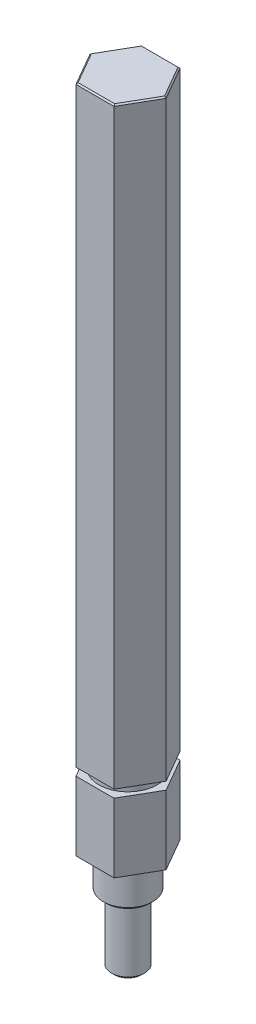
ISO-10303-21;
HEADER;
FILE_DESCRIPTION(('STEP AP214'),'2;1');
FILE_NAME('part.step','',(''),(''),'','','');
FILE_SCHEMA(('AUTOMOTIVE_DESIGN { 1 0 10303 214 1 1 1 1 }'));
ENDSEC;
DATA;
#1=APPLICATION_CONTEXT('core data for automotive mechanical design processes');
#2=APPLICATION_PROTOCOL_DEFINITION('international standard','automotive_design',2000,#1);
#3=PRODUCT_CONTEXT('',#1,'mechanical');
#4=PRODUCT('Part','Part','',(#3));
#5=PRODUCT_RELATED_PRODUCT_CATEGORY('part','',(#4));
#6=PRODUCT_DEFINITION_FORMATION('','',#4);
#7=PRODUCT_DEFINITION_CONTEXT('part definition',#1,'design');
#8=PRODUCT_DEFINITION('design','',#6,#7);
#9=PRODUCT_DEFINITION_SHAPE('','',#8);
#10=(LENGTH_UNIT() NAMED_UNIT(*) SI_UNIT(.MILLI.,.METRE.));
#11=(NAMED_UNIT(*) PLANE_ANGLE_UNIT() SI_UNIT($,.RADIAN.));
#12=(NAMED_UNIT(*) SI_UNIT($,.STERADIAN.) SOLID_ANGLE_UNIT());
#13=UNCERTAINTY_MEASURE_WITH_UNIT(LENGTH_MEASURE(1.E-05),#10,'distance_accuracy_value','');
#14=(GEOMETRIC_REPRESENTATION_CONTEXT(3) GLOBAL_UNCERTAINTY_ASSIGNED_CONTEXT((#13)) GLOBAL_UNIT_ASSIGNED_CONTEXT((#10,
#11,#12)) REPRESENTATION_CONTEXT('',''));
#15=CARTESIAN_POINT('',(0.,0.,0.));
#16=DIRECTION('',(0.,0.,1.));
#17=DIRECTION('',(1.,0.,0.));
#18=AXIS2_PLACEMENT_3D('',#15,#16,#17);
#19=CARTESIAN_POINT('',(0.,-12.1158,0.));
#20=DIRECTION('',(0.,-1.,0.));
#21=DIRECTION('',(0.,0.,-1.));
#22=AXIS2_PLACEMENT_3D('',#19,#20,#21);
#23=PLANE('',#22);
#24=DIRECTION('',(-0.500000000000001,0.,-0.866025403784438));
#25=VECTOR('',#24,1.);
#26=CARTESIAN_POINT('',(-41.9733079254973,-12.1158,-10.319011646302));
#27=LINE('',#26,#25);
#28=CARTESIAN_POINT('',(-41.9733079254973,-12.1158,-10.319011646302));
#29=VERTEX_POINT('',#28);
#30=CARTESIAN_POINT('',(-45.6394821348514,-12.1158,-16.669011646302));
#31=VERTEX_POINT('',#30);
#32=EDGE_CURVE('E183',#29,#31,#27,.T.);
#33=ORIENTED_EDGE('',*,*,#32,.F.);
#34=DIRECTION('',(-1.,0.,0.));
#35=VECTOR('',#34,1.);
#36=CARTESIAN_POINT('',(-34.640959506789,-12.1158,-10.319011646302));
#37=LINE('',#36,#35);
#38=CARTESIAN_POINT('',(-34.640959506789,-12.1158,-10.319011646302));
#39=VERTEX_POINT('',#38);
#40=EDGE_CURVE('E199',#39,#29,#37,.T.);
#41=ORIENTED_EDGE('',*,*,#40,.F.);
#42=DIRECTION('',(-0.500000000000001,0.,0.866025403784438));
#43=VECTOR('',#42,1.);
#44=CARTESIAN_POINT('',(-30.9747852974349,-12.1158,-16.669011646302));
#45=LINE('',#44,#43);
#46=CARTESIAN_POINT('',(-30.9747852974349,-12.1158,-16.669011646302));
#47=VERTEX_POINT('',#46);
#48=EDGE_CURVE('E196',#47,#39,#45,.T.);
#49=ORIENTED_EDGE('',*,*,#48,.F.);
#50=DIRECTION('',(0.500000000000001,0.,0.866025403784438));
#51=VECTOR('',#50,1.);
#52=CARTESIAN_POINT('',(-34.640959506789,-12.1158,-23.019011646302));
#53=LINE('',#52,#51);
#54=CARTESIAN_POINT('',(-34.640959506789,-12.1158,-23.019011646302));
#55=VERTEX_POINT('',#54);
#56=EDGE_CURVE('E193',#55,#47,#53,.T.);
#57=ORIENTED_EDGE('',*,*,#56,.F.);
#58=DIRECTION('',(1.,0.,0.));
#59=VECTOR('',#58,1.);
#60=CARTESIAN_POINT('',(-41.9733079254973,-12.1158,-23.019011646302));
#61=LINE('',#60,#59);
#62=CARTESIAN_POINT('',(-41.9733079254973,-12.1158,-23.019011646302));
#63=VERTEX_POINT('',#62);
#64=EDGE_CURVE('E190',#63,#55,#61,.T.);
#65=ORIENTED_EDGE('',*,*,#64,.F.);
#66=DIRECTION('',(0.5,0.,-0.866025403784439));
#67=VECTOR('',#66,1.);
#68=CARTESIAN_POINT('',(-45.6394821348514,-12.1158,-16.669011646302));
#69=LINE('',#68,#67);
#70=EDGE_CURVE('E186',#31,#63,#69,.T.);
#71=ORIENTED_EDGE('',*,*,#70,.F.);
#72=EDGE_LOOP('',(#33,#41,#49,#57,#65,#71));
#73=FACE_BOUND('',#72,.T.);
#74=CARTESIAN_POINT('',(-38.3071337161431,-12.1158,-16.669011646302));
#75=DIRECTION('',(0.,-1.,0.));
#76=DIRECTION('',(0.,0.,-1.));
#77=AXIS2_PLACEMENT_3D('',#74,#75,#76);
#78=CIRCLE('',#77,5.58800000000003);
#79=CARTESIAN_POINT('',(-38.3071337161431,-12.1158,-22.257011646302));
#80=VERTEX_POINT('',#79);
#81=EDGE_CURVE('E221',#80,#80,#78,.F.);
#82=ORIENTED_EDGE('',*,*,#81,.F.);
#83=EDGE_LOOP('',(#82));
#84=FACE_BOUND('',#83,.T.);
#85=ADVANCED_FACE('F32',(#73,#84),#23,.F.);
#86=CARTESIAN_POINT('',(-41.9733079254973,-12.1158,-10.319011646302));
#87=DIRECTION('',(-0.866025403784438,0.,0.500000000000001));
#88=DIRECTION('',(0.500000000000001,0.,0.866025403784438));
#89=AXIS2_PLACEMENT_3D('',#86,#87,#88);
#90=PLANE('',#89);
#91=DIRECTION('',(-0.500000000000001,0.,-0.866025403784438));
#92=VECTOR('',#91,1.);
#93=CARTESIAN_POINT('',(-41.9733079254973,-25.4,-10.319011646302));
#94=LINE('',#93,#92);
#95=CARTESIAN_POINT('',(-41.9733079254973,-25.4,-10.319011646302));
#96=VERTEX_POINT('',#95);
#97=CARTESIAN_POINT('',(-45.6394821348514,-25.4,-16.669011646302));
#98=VERTEX_POINT('',#97);
#99=EDGE_CURVE('E182',#96,#98,#94,.T.);
#100=ORIENTED_EDGE('',*,*,#99,.F.);
#101=DIRECTION('',(0.,-1.,0.));
#102=VECTOR('',#101,1.);
#103=CARTESIAN_POINT('',(-41.9733079254973,-12.1158,-10.319011646302));
#104=LINE('',#103,#102);
#105=EDGE_CURVE('E219',#29,#96,#104,.T.);
#106=ORIENTED_EDGE('',*,*,#105,.F.);
#107=ORIENTED_EDGE('',*,*,#32,.T.);
#108=DIRECTION('',(0.,-1.,0.));
#109=VECTOR('',#108,1.);
#110=CARTESIAN_POINT('',(-45.6394821348514,-12.1158,-16.669011646302));
#111=LINE('',#110,#109);
#112=EDGE_CURVE('E202',#31,#98,#111,.T.);
#113=ORIENTED_EDGE('',*,*,#112,.T.);
#114=EDGE_LOOP('',(#100,#106,#107,#113));
#115=FACE_BOUND('',#114,.T.);
#116=ADVANCED_FACE('F324',(#115),#90,.T.);
#117=CARTESIAN_POINT('',(-34.640959506789,-12.1158,-10.319011646302));
#118=DIRECTION('',(0.,0.,1.));
#119=DIRECTION('',(1.,0.,0.));
#120=AXIS2_PLACEMENT_3D('',#117,#118,#119);
#121=PLANE('',#120);
#122=DIRECTION('',(-1.,0.,0.));
#123=VECTOR('',#122,1.);
#124=CARTESIAN_POINT('',(-34.640959506789,-25.4,-10.319011646302));
#125=LINE('',#124,#123);
#126=CARTESIAN_POINT('',(-34.640959506789,-25.4,-10.319011646302));
#127=VERTEX_POINT('',#126);
#128=EDGE_CURVE('E187',#127,#96,#125,.T.);
#129=ORIENTED_EDGE('',*,*,#128,.F.);
#130=DIRECTION('',(0.,-1.,0.));
#131=VECTOR('',#130,1.);
#132=CARTESIAN_POINT('',(-34.640959506789,-12.1158,-10.319011646302));
#133=LINE('',#132,#131);
#134=EDGE_CURVE('E222',#39,#127,#133,.T.);
#135=ORIENTED_EDGE('',*,*,#134,.F.);
#136=ORIENTED_EDGE('',*,*,#40,.T.);
#137=ORIENTED_EDGE('',*,*,#105,.T.);
#138=EDGE_LOOP('',(#129,#135,#136,#137));
#139=FACE_BOUND('',#138,.T.);
#140=ADVANCED_FACE('F330',(#139),#121,.T.);
#141=CARTESIAN_POINT('',(-30.9747852974349,-12.1158,-16.669011646302));
#142=DIRECTION('',(0.866025403784438,0.,0.500000000000001));
#143=DIRECTION('',(0.500000000000001,0.,-0.866025403784438));
#144=AXIS2_PLACEMENT_3D('',#141,#142,#143);
#145=PLANE('',#144);
#146=DIRECTION('',(-0.500000000000001,0.,0.866025403784438));
#147=VECTOR('',#146,1.);
#148=CARTESIAN_POINT('',(-30.9747852974349,-25.4,-16.669011646302));
#149=LINE('',#148,#147);
#150=CARTESIAN_POINT('',(-30.9747852974349,-25.4,-16.669011646302));
#151=VERTEX_POINT('',#150);
#152=EDGE_CURVE('E214',#151,#127,#149,.T.);
#153=ORIENTED_EDGE('',*,*,#152,.F.);
#154=DIRECTION('',(0.,-1.,0.));
#155=VECTOR('',#154,1.);
#156=CARTESIAN_POINT('',(-30.9747852974349,-12.1158,-16.669011646302));
#157=LINE('',#156,#155);
#158=EDGE_CURVE('E224',#47,#151,#157,.T.);
#159=ORIENTED_EDGE('',*,*,#158,.F.);
#160=ORIENTED_EDGE('',*,*,#48,.T.);
#161=ORIENTED_EDGE('',*,*,#134,.T.);
#162=EDGE_LOOP('',(#153,#159,#160,#161));
#163=FACE_BOUND('',#162,.T.);
#164=ADVANCED_FACE('F346',(#163),#145,.T.);
#165=CARTESIAN_POINT('',(-34.640959506789,-12.1158,-23.019011646302));
#166=DIRECTION('',(0.866025403784438,0.,-0.500000000000001));
#167=DIRECTION('',(-0.500000000000001,0.,-0.866025403784438));
#168=AXIS2_PLACEMENT_3D('',#165,#166,#167);
#169=PLANE('',#168);
#170=DIRECTION('',(0.500000000000001,0.,0.866025403784438));
#171=VECTOR('',#170,1.);
#172=CARTESIAN_POINT('',(-34.640959506789,-25.4,-23.019011646302));
#173=LINE('',#172,#171);
#174=CARTESIAN_POINT('',(-34.640959506789,-25.4,-23.019011646302));
#175=VERTEX_POINT('',#174);
#176=EDGE_CURVE('E211',#175,#151,#173,.T.);
#177=ORIENTED_EDGE('',*,*,#176,.F.);
#178=DIRECTION('',(0.,-1.,0.));
#179=VECTOR('',#178,1.);
#180=CARTESIAN_POINT('',(-34.640959506789,-12.1158,-23.019011646302));
#181=LINE('',#180,#179);
#182=EDGE_CURVE('E226',#55,#175,#181,.T.);
#183=ORIENTED_EDGE('',*,*,#182,.F.);
#184=ORIENTED_EDGE('',*,*,#56,.T.);
#185=ORIENTED_EDGE('',*,*,#158,.T.);
#186=EDGE_LOOP('',(#177,#183,#184,#185));
#187=FACE_BOUND('',#186,.T.);
#188=ADVANCED_FACE('F350',(#187),#169,.T.);
#189=CARTESIAN_POINT('',(-41.9733079254973,-12.1158,-23.019011646302));
#190=DIRECTION('',(0.,0.,-1.));
#191=DIRECTION('',(-1.,0.,0.));
#192=AXIS2_PLACEMENT_3D('',#189,#190,#191);
#193=PLANE('',#192);
#194=DIRECTION('',(1.,0.,0.));
#195=VECTOR('',#194,1.);
#196=CARTESIAN_POINT('',(-41.9733079254973,-25.4,-23.019011646302));
#197=LINE('',#196,#195);
#198=CARTESIAN_POINT('',(-41.9733079254973,-25.4,-23.019011646302));
#199=VERTEX_POINT('',#198);
#200=EDGE_CURVE('E208',#199,#175,#197,.T.);
#201=ORIENTED_EDGE('',*,*,#200,.F.);
#202=DIRECTION('',(0.,-1.,0.));
#203=VECTOR('',#202,1.);
#204=CARTESIAN_POINT('',(-41.9733079254973,-12.1158,-23.019011646302));
#205=LINE('',#204,#203);
#206=EDGE_CURVE('E228',#63,#199,#205,.T.);
#207=ORIENTED_EDGE('',*,*,#206,.F.);
#208=ORIENTED_EDGE('',*,*,#64,.T.);
#209=ORIENTED_EDGE('',*,*,#182,.T.);
#210=EDGE_LOOP('',(#201,#207,#208,#209));
#211=FACE_BOUND('',#210,.T.);
#212=ADVANCED_FACE('F354',(#211),#193,.T.);
#213=CARTESIAN_POINT('',(-45.6394821348514,-12.1158,-16.669011646302));
#214=DIRECTION('',(-0.866025403784439,0.,-0.5));
#215=DIRECTION('',(-0.5,0.,0.866025403784439));
#216=AXIS2_PLACEMENT_3D('',#213,#214,#215);
#217=PLANE('',#216);
#218=DIRECTION('',(0.5,0.,-0.866025403784439));
#219=VECTOR('',#218,1.);
#220=CARTESIAN_POINT('',(-45.6394821348514,-25.4,-16.669011646302));
#221=LINE('',#220,#219);
#222=EDGE_CURVE('E205',#98,#199,#221,.T.);
#223=ORIENTED_EDGE('',*,*,#222,.F.);
#224=ORIENTED_EDGE('',*,*,#112,.F.);
#225=ORIENTED_EDGE('',*,*,#70,.T.);
#226=ORIENTED_EDGE('',*,*,#206,.T.);
#227=EDGE_LOOP('',(#223,#224,#225,#226));
#228=FACE_BOUND('',#227,.T.);
#229=ADVANCED_FACE('F342',(#228),#217,.T.);
#230=CARTESIAN_POINT('',(0.,-25.4,0.));
#231=DIRECTION('',(0.,-1.,0.));
#232=DIRECTION('',(0.,0.,-1.));
#233=AXIS2_PLACEMENT_3D('',#230,#231,#232);
#234=PLANE('',#233);
#235=CARTESIAN_POINT('',(-38.3071337161431,-25.4,-16.669011646302));
#236=DIRECTION('',(0.,-1.,0.));
#237=DIRECTION('',(0.,0.,-1.));
#238=AXIS2_PLACEMENT_3D('',#235,#236,#237);
#239=CIRCLE('',#238,4.7498);
#240=CARTESIAN_POINT('',(-38.3071337161431,-25.4,-21.418811646302));
#241=VERTEX_POINT('',#240);
#242=EDGE_CURVE('E233',#241,#241,#239,.T.);
#243=ORIENTED_EDGE('',*,*,#242,.F.);
#244=EDGE_LOOP('',(#243));
#245=FACE_BOUND('',#244,.T.);
#246=ORIENTED_EDGE('',*,*,#99,.T.);
#247=ORIENTED_EDGE('',*,*,#222,.T.);
#248=ORIENTED_EDGE('',*,*,#200,.T.);
#249=ORIENTED_EDGE('',*,*,#176,.T.);
#250=ORIENTED_EDGE('',*,*,#152,.T.);
#251=ORIENTED_EDGE('',*,*,#128,.T.);
#252=EDGE_LOOP('',(#246,#247,#248,#249,#250,#251));
#253=FACE_BOUND('',#252,.T.);
#254=ADVANCED_FACE('F339',(#245,#253),#234,.T.);
#255=CARTESIAN_POINT('',(-38.3071337161431,-10.6172,-16.669011646302));
#256=DIRECTION('',(0.,-1.,0.));
#257=DIRECTION('',(0.,0.,-1.));
#258=AXIS2_PLACEMENT_3D('',#255,#256,#257);
#259=CYLINDRICAL_SURFACE('',#258,5.58800000000003);
#260=CARTESIAN_POINT('',(-38.3071337161431,-10.6172,-16.669011646302));
#261=DIRECTION('',(0.,1.,0.));
#262=DIRECTION('',(0.,0.,1.));
#263=AXIS2_PLACEMENT_3D('',#260,#261,#262);
#264=CIRCLE('',#263,5.58800000000003);
#265=CARTESIAN_POINT('',(-38.3071337161431,-10.6172,-11.081011646302));
#266=VERTEX_POINT('',#265);
#267=EDGE_CURVE('E172',#266,#266,#264,.T.);
#268=ORIENTED_EDGE('',*,*,#267,.F.);
#269=EDGE_LOOP('',(#268));
#270=FACE_BOUND('',#269,.T.);
#271=ORIENTED_EDGE('',*,*,#81,.T.);
#272=EDGE_LOOP('',(#271));
#273=FACE_BOUND('',#272,.T.);
#274=ADVANCED_FACE('F337',(#270,#273),#259,.T.);
#275=CARTESIAN_POINT('',(0.,-10.6172,0.));
#276=DIRECTION('',(0.,-1.,0.));
#277=DIRECTION('',(0.,0.,-1.));
#278=AXIS2_PLACEMENT_3D('',#275,#276,#277);
#279=PLANE('',#278);
#280=DIRECTION('',(-0.5,0.,-0.866025403784439));
#281=VECTOR('',#280,1.);
#282=CARTESIAN_POINT('',(-41.9733079254973,-10.6172,-10.3190116463019));
#283=LINE('',#282,#281);
#284=CARTESIAN_POINT('',(-41.9733079254973,-10.6172,-10.3190116463019));
#285=VERTEX_POINT('',#284);
#286=CARTESIAN_POINT('',(-45.6394821348515,-10.6172,-16.6690116463019));
#287=VERTEX_POINT('',#286);
#288=EDGE_CURVE('E141',#285,#287,#283,.T.);
#289=ORIENTED_EDGE('',*,*,#288,.T.);
#290=DIRECTION('',(0.5,0.,-0.866025403784438));
#291=VECTOR('',#290,1.);
#292=CARTESIAN_POINT('',(-45.6394821348515,-10.6172,-16.6690116463019));
#293=LINE('',#292,#291);
#294=CARTESIAN_POINT('',(-41.9733079254973,-10.6172,-23.0190116463019));
#295=VERTEX_POINT('',#294);
#296=EDGE_CURVE('E147',#287,#295,#293,.T.);
#297=ORIENTED_EDGE('',*,*,#296,.T.);
#298=DIRECTION('',(1.,0.,0.));
#299=VECTOR('',#298,1.);
#300=CARTESIAN_POINT('',(-41.9733079254973,-10.6172,-23.0190116463019));
#301=LINE('',#300,#299);
#302=CARTESIAN_POINT('',(-34.6409595067891,-10.6172,-23.0190116463019));
#303=VERTEX_POINT('',#302);
#304=EDGE_CURVE('E152',#295,#303,#301,.T.);
#305=ORIENTED_EDGE('',*,*,#304,.T.);
#306=DIRECTION('',(0.500000000000001,0.,0.866025403784438));
#307=VECTOR('',#306,1.);
#308=CARTESIAN_POINT('',(-34.6409595067891,-10.6172,-23.0190116463019));
#309=LINE('',#308,#307);
#310=CARTESIAN_POINT('',(-30.974785297435,-10.6172,-16.6690116463019));
#311=VERTEX_POINT('',#310);
#312=EDGE_CURVE('E164',#303,#311,#309,.T.);
#313=ORIENTED_EDGE('',*,*,#312,.T.);
#314=DIRECTION('',(-0.500000000000001,0.,0.866025403784438));
#315=VECTOR('',#314,1.);
#316=CARTESIAN_POINT('',(-30.974785297435,-10.6172,-16.6690116463019));
#317=LINE('',#316,#315);
#318=CARTESIAN_POINT('',(-34.6409595067891,-10.6172,-10.3190116463019));
#319=VERTEX_POINT('',#318);
#320=EDGE_CURVE('E167',#311,#319,#317,.T.);
#321=ORIENTED_EDGE('',*,*,#320,.T.);
#322=DIRECTION('',(-1.,0.,0.));
#323=VECTOR('',#322,1.);
#324=CARTESIAN_POINT('',(-34.6409595067891,-10.6172,-10.3190116463019));
#325=LINE('',#324,#323);
#326=EDGE_CURVE('E144',#319,#285,#325,.T.);
#327=ORIENTED_EDGE('',*,*,#326,.T.);
#328=EDGE_LOOP('',(#289,#297,#305,#313,#321,#327));
#329=FACE_BOUND('',#328,.T.);
#330=ORIENTED_EDGE('',*,*,#267,.T.);
#331=EDGE_LOOP('',(#330));
#332=FACE_BOUND('',#331,.T.);
#333=ADVANCED_FACE('F154',(#329,#332),#279,.T.);
#334=CARTESIAN_POINT('',(-41.9733079254973,103.43134,-10.3190116463019));
#335=DIRECTION('',(-0.866025403784439,0.,0.5));
#336=DIRECTION('',(0.5,0.,0.866025403784439));
#337=AXIS2_PLACEMENT_3D('',#334,#335,#336);
#338=PLANE('',#337);
#339=DIRECTION('',(0.,-1.,0.));
#340=VECTOR('',#339,1.);
#341=CARTESIAN_POINT('',(-41.9733079254973,103.43134,-10.3190116463019));
#342=LINE('',#341,#340);
#343=CARTESIAN_POINT('',(-41.9733079254973,103.17734,-10.3190116463019));
#344=VERTEX_POINT('',#343);
#345=EDGE_CURVE('E170',#344,#285,#342,.T.);
#346=ORIENTED_EDGE('',*,*,#345,.F.);
#347=DIRECTION('',(-0.5,0.,-0.866025403784439));
#348=VECTOR('',#347,1.);
#349=CARTESIAN_POINT('',(-45.6394821348515,103.17734,-16.6690116463019));
#350=LINE('',#349,#348);
#351=CARTESIAN_POINT('',(-45.6394821348515,103.17734,-16.6690116463019));
#352=VERTEX_POINT('',#351);
#353=EDGE_CURVE('E41',#344,#352,#350,.T.);
#354=ORIENTED_EDGE('',*,*,#353,.T.);
#355=DIRECTION('',(0.,-1.,0.));
#356=VECTOR('',#355,1.);
#357=CARTESIAN_POINT('',(-45.6394821348515,103.43134,-16.6690116463019));
#358=LINE('',#357,#356);
#359=EDGE_CURVE('E137',#352,#287,#358,.T.);
#360=ORIENTED_EDGE('',*,*,#359,.T.);
#361=ORIENTED_EDGE('',*,*,#288,.F.);
#362=EDGE_LOOP('',(#346,#354,#360,#361));
#363=FACE_BOUND('',#362,.T.);
#364=ADVANCED_FACE('F139',(#363),#338,.T.);
#365=CARTESIAN_POINT('',(-34.6409595067891,103.43134,-10.3190116463019));
#366=DIRECTION('',(0.,0.,1.));
#367=DIRECTION('',(1.,0.,0.));
#368=AXIS2_PLACEMENT_3D('',#365,#366,#367);
#369=PLANE('',#368);
#370=DIRECTION('',(0.,-1.,0.));
#371=VECTOR('',#370,1.);
#372=CARTESIAN_POINT('',(-34.6409595067891,103.43134,-10.3190116463019));
#373=LINE('',#372,#371);
#374=CARTESIAN_POINT('',(-34.6409595067891,103.17734,-10.3190116463019));
#375=VERTEX_POINT('',#374);
#376=EDGE_CURVE('E173',#375,#319,#373,.T.);
#377=ORIENTED_EDGE('',*,*,#376,.F.);
#378=DIRECTION('',(-1.,0.,0.));
#379=VECTOR('',#378,1.);
#380=CARTESIAN_POINT('',(-41.9733079254973,103.17734,-10.3190116463019));
#381=LINE('',#380,#379);
#382=EDGE_CURVE('E266',#375,#344,#381,.T.);
#383=ORIENTED_EDGE('',*,*,#382,.T.);
#384=ORIENTED_EDGE('',*,*,#345,.T.);
#385=ORIENTED_EDGE('',*,*,#326,.F.);
#386=EDGE_LOOP('',(#377,#383,#384,#385));
#387=FACE_BOUND('',#386,.T.);
#388=ADVANCED_FACE('F459',(#387),#369,.T.);
#389=CARTESIAN_POINT('',(-30.974785297435,103.43134,-16.6690116463019));
#390=DIRECTION('',(0.866025403784438,0.,0.500000000000001));
#391=DIRECTION('',(0.500000000000001,0.,-0.866025403784438));
#392=AXIS2_PLACEMENT_3D('',#389,#390,#391);
#393=PLANE('',#392);
#394=DIRECTION('',(0.,-1.,0.));
#395=VECTOR('',#394,1.);
#396=CARTESIAN_POINT('',(-30.974785297435,103.43134,-16.6690116463019));
#397=LINE('',#396,#395);
#398=CARTESIAN_POINT('',(-30.974785297435,103.17734,-16.6690116463019));
#399=VERTEX_POINT('',#398);
#400=EDGE_CURVE('E175',#399,#311,#397,.T.);
#401=ORIENTED_EDGE('',*,*,#400,.F.);
#402=DIRECTION('',(-0.500000000000001,0.,0.866025403784438));
#403=VECTOR('',#402,1.);
#404=CARTESIAN_POINT('',(-34.6409595067891,103.17734,-10.3190116463019));
#405=LINE('',#404,#403);
#406=EDGE_CURVE('E248',#399,#375,#405,.T.);
#407=ORIENTED_EDGE('',*,*,#406,.T.);
#408=ORIENTED_EDGE('',*,*,#376,.T.);
#409=ORIENTED_EDGE('',*,*,#320,.F.);
#410=EDGE_LOOP('',(#401,#407,#408,#409));
#411=FACE_BOUND('',#410,.T.);
#412=ADVANCED_FACE('F311',(#411),#393,.T.);
#413=CARTESIAN_POINT('',(-34.6409595067891,103.43134,-23.0190116463019));
#414=DIRECTION('',(0.866025403784438,0.,-0.500000000000001));
#415=DIRECTION('',(-0.500000000000001,0.,-0.866025403784438));
#416=AXIS2_PLACEMENT_3D('',#413,#414,#415);
#417=PLANE('',#416);
#418=DIRECTION('',(0.,-1.,0.));
#419=VECTOR('',#418,1.);
#420=CARTESIAN_POINT('',(-34.6409595067891,103.43134,-23.0190116463019));
#421=LINE('',#420,#419);
#422=CARTESIAN_POINT('',(-34.6409595067891,103.17734,-23.0190116463019));
#423=VERTEX_POINT('',#422);
#424=EDGE_CURVE('E177',#423,#303,#421,.T.);
#425=ORIENTED_EDGE('',*,*,#424,.F.);
#426=DIRECTION('',(0.500000000000001,0.,0.866025403784438));
#427=VECTOR('',#426,1.);
#428=CARTESIAN_POINT('',(-30.974785297435,103.17734,-16.6690116463019));
#429=LINE('',#428,#427);
#430=EDGE_CURVE('E264',#423,#399,#429,.T.);
#431=ORIENTED_EDGE('',*,*,#430,.T.);
#432=ORIENTED_EDGE('',*,*,#400,.T.);
#433=ORIENTED_EDGE('',*,*,#312,.F.);
#434=EDGE_LOOP('',(#425,#431,#432,#433));
#435=FACE_BOUND('',#434,.T.);
#436=ADVANCED_FACE('F307',(#435),#417,.T.);
#437=CARTESIAN_POINT('',(-41.9733079254973,103.43134,-23.0190116463019));
#438=DIRECTION('',(0.,0.,-1.));
#439=DIRECTION('',(-1.,0.,0.));
#440=AXIS2_PLACEMENT_3D('',#437,#438,#439);
#441=PLANE('',#440);
#442=DIRECTION('',(0.,-1.,0.));
#443=VECTOR('',#442,1.);
#444=CARTESIAN_POINT('',(-41.9733079254973,103.43134,-23.0190116463019));
#445=LINE('',#444,#443);
#446=CARTESIAN_POINT('',(-41.9733079254973,103.17734,-23.0190116463019));
#447=VERTEX_POINT('',#446);
#448=EDGE_CURVE('E143',#447,#295,#445,.T.);
#449=ORIENTED_EDGE('',*,*,#448,.F.);
#450=DIRECTION('',(1.,0.,0.));
#451=VECTOR('',#450,1.);
#452=CARTESIAN_POINT('',(-34.6409595067891,103.17734,-23.0190116463019));
#453=LINE('',#452,#451);
#454=EDGE_CURVE('E268',#447,#423,#453,.T.);
#455=ORIENTED_EDGE('',*,*,#454,.T.);
#456=ORIENTED_EDGE('',*,*,#424,.T.);
#457=ORIENTED_EDGE('',*,*,#304,.F.);
#458=EDGE_LOOP('',(#449,#455,#456,#457));
#459=FACE_BOUND('',#458,.T.);
#460=ADVANCED_FACE('F314',(#459),#441,.T.);
#461=CARTESIAN_POINT('',(-45.6394821348515,103.43134,-16.6690116463019));
#462=DIRECTION('',(-0.866025403784439,0.,-0.5));
#463=DIRECTION('',(-0.5,0.,0.866025403784439));
#464=AXIS2_PLACEMENT_3D('',#461,#462,#463);
#465=PLANE('',#464);
#466=ORIENTED_EDGE('',*,*,#359,.F.);
#467=DIRECTION('',(0.5,0.,-0.866025403784439));
#468=VECTOR('',#467,1.);
#469=CARTESIAN_POINT('',(-41.9733079254973,103.17734,-23.0190116463019));
#470=LINE('',#469,#468);
#471=EDGE_CURVE('E11',#352,#447,#470,.T.);
#472=ORIENTED_EDGE('',*,*,#471,.T.);
#473=ORIENTED_EDGE('',*,*,#448,.T.);
#474=ORIENTED_EDGE('',*,*,#296,.F.);
#475=EDGE_LOOP('',(#466,#472,#473,#474));
#476=FACE_BOUND('',#475,.T.);
#477=ADVANCED_FACE('F148',(#476),#465,.T.);
#478=CARTESIAN_POINT('',(0.,103.43134,0.));
#479=DIRECTION('',(0.,-1.,0.));
#480=DIRECTION('',(0.,0.,-1.));
#481=AXIS2_PLACEMENT_3D('',#478,#479,#480);
#482=PLANE('',#481);
#483=DIRECTION('',(1.,0.,0.));
#484=VECTOR('',#483,1.);
#485=CARTESIAN_POINT('',(-34.6409595067891,103.43134,-10.5730116463019));
#486=LINE('',#485,#484);
#487=CARTESIAN_POINT('',(-41.8266609571232,103.43134,-10.5730116463019));
#488=VERTEX_POINT('',#487);
#489=CARTESIAN_POINT('',(-34.7876064751633,103.43134,-10.5730116463019));
#490=VERTEX_POINT('',#489);
#491=EDGE_CURVE('E257',#488,#490,#486,.T.);
#492=ORIENTED_EDGE('',*,*,#491,.T.);
#493=DIRECTION('',(0.500000000000001,0.,-0.866025403784438));
#494=VECTOR('',#493,1.);
#495=CARTESIAN_POINT('',(-31.1947557499962,103.43134,-16.7960116463019));
#496=LINE('',#495,#494);
#497=CARTESIAN_POINT('',(-31.2680792341833,103.43134,-16.6690116463019));
#498=VERTEX_POINT('',#497);
#499=EDGE_CURVE('E261',#490,#498,#496,.T.);
#500=ORIENTED_EDGE('',*,*,#499,.T.);
#501=DIRECTION('',(-0.500000000000001,0.,-0.866025403784438));
#502=VECTOR('',#501,1.);
#503=CARTESIAN_POINT('',(-34.8609299593503,103.43134,-22.8920116463019));
#504=LINE('',#503,#502);
#505=CARTESIAN_POINT('',(-34.7876064751633,103.43134,-22.7650116463019));
#506=VERTEX_POINT('',#505);
#507=EDGE_CURVE('E259',#498,#506,#504,.T.);
#508=ORIENTED_EDGE('',*,*,#507,.T.);
#509=DIRECTION('',(-1.,0.,0.));
#510=VECTOR('',#509,1.);
#511=CARTESIAN_POINT('',(-41.9733079254973,103.43134,-22.7650116463019));
#512=LINE('',#511,#510);
#513=CARTESIAN_POINT('',(-41.8266609571232,103.43134,-22.7650116463019));
#514=VERTEX_POINT('',#513);
#515=EDGE_CURVE('E255',#506,#514,#512,.T.);
#516=ORIENTED_EDGE('',*,*,#515,.T.);
#517=DIRECTION('',(-0.5,0.,0.866025403784439));
#518=VECTOR('',#517,1.);
#519=CARTESIAN_POINT('',(-45.4195116822902,103.43134,-16.5420116463019));
#520=LINE('',#519,#518);
#521=CARTESIAN_POINT('',(-45.3461881981031,103.43134,-16.6690116463019));
#522=VERTEX_POINT('',#521);
#523=EDGE_CURVE('E251',#514,#522,#520,.T.);
#524=ORIENTED_EDGE('',*,*,#523,.T.);
#525=DIRECTION('',(0.5,0.,0.866025403784439));
#526=VECTOR('',#525,1.);
#527=CARTESIAN_POINT('',(-41.7533374729361,103.43134,-10.4460116463019));
#528=LINE('',#527,#526);
#529=EDGE_CURVE('E253',#522,#488,#528,.T.);
#530=ORIENTED_EDGE('',*,*,#529,.T.);
#531=EDGE_LOOP('',(#492,#500,#508,#516,#524,#530));
#532=FACE_BOUND('',#531,.T.);
#533=ADVANCED_FACE('F295',(#532),#482,.F.);
#534=CARTESIAN_POINT('',(-38.3071337161431,-45.212,-16.669011646302));
#535=DIRECTION('',(0.,1.,0.));
#536=DIRECTION('',(0.,0.,1.));
#537=AXIS2_PLACEMENT_3D('',#534,#535,#536);
#538=CYLINDRICAL_SURFACE('',#537,3.1623);
#539=CARTESIAN_POINT('',(-38.3071337161431,-44.704000000049,-16.669011646302));
#540=DIRECTION('',(0.,-1.,0.));
#541=DIRECTION('',(0.,0.,-1.));
#542=AXIS2_PLACEMENT_3D('',#539,#540,#541);
#543=CIRCLE('',#542,3.1623);
#544=CARTESIAN_POINT('',(-38.3071337161431,-44.704000000049,-19.831311646302));
#545=VERTEX_POINT('',#544);
#546=EDGE_CURVE('E242',#545,#545,#543,.F.);
#547=ORIENTED_EDGE('',*,*,#546,.T.);
#548=EDGE_LOOP('',(#547));
#549=FACE_BOUND('',#548,.T.);
#550=CARTESIAN_POINT('',(-38.3071337161431,-32.512,-16.669011646302));
#551=DIRECTION('',(0.,1.,0.));
#552=DIRECTION('',(0.,0.,1.));
#553=AXIS2_PLACEMENT_3D('',#550,#551,#552);
#554=CIRCLE('',#553,3.1623);
#555=CARTESIAN_POINT('',(-38.3071337161431,-32.512,-13.506711646302));
#556=VERTEX_POINT('',#555);
#557=EDGE_CURVE('E158',#556,#556,#554,.T.);
#558=ORIENTED_EDGE('',*,*,#557,.F.);
#559=EDGE_LOOP('',(#558));
#560=FACE_BOUND('',#559,.T.);
#561=ADVANCED_FACE('F421',(#549,#560),#538,.T.);
#562=CARTESIAN_POINT('',(-35.1448337161431,-45.212,-16.669011646302));
#563=DIRECTION('',(0.,-1.,0.));
#564=DIRECTION('',(0.,0.,-1.));
#565=AXIS2_PLACEMENT_3D('',#562,#563,#564);
#566=PLANE('',#565);
#567=CARTESIAN_POINT('',(-38.3071337161431,-45.212,-16.669011646302));
#568=DIRECTION('',(0.,-1.,0.));
#569=DIRECTION('',(0.,0.,-1.));
#570=AXIS2_PLACEMENT_3D('',#567,#568,#569);
#571=CIRCLE('',#570,2.65430000004901);
#572=CARTESIAN_POINT('',(-38.3071337161431,-45.212,-19.323311646351));
#573=VERTEX_POINT('',#572);
#574=EDGE_CURVE('E245',#573,#573,#571,.T.);
#575=ORIENTED_EDGE('',*,*,#574,.T.);
#576=EDGE_LOOP('',(#575));
#577=FACE_BOUND('',#576,.T.);
#578=ADVANCED_FACE('F413',(#577),#566,.T.);
#579=CARTESIAN_POINT('',(-38.3071337161431,-45.212,-16.669011646302));
#580=DIRECTION('',(0.,1.,0.));
#581=DIRECTION('',(0.,0.,1.));
#582=AXIS2_PLACEMENT_3D('',#579,#580,#581);
#583=CYLINDRICAL_SURFACE('',#582,4.7498);
#584=CARTESIAN_POINT('',(-38.3071337161431,-32.004000000049,-16.669011646302));
#585=DIRECTION('',(0.,-1.,0.));
#586=DIRECTION('',(0.,0.,-1.));
#587=AXIS2_PLACEMENT_3D('',#584,#585,#586);
#588=CIRCLE('',#587,4.7498);
#589=CARTESIAN_POINT('',(-38.3071337161431,-32.004000000049,-21.418811646302));
#590=VERTEX_POINT('',#589);
#591=EDGE_CURVE('E236',#590,#590,#588,.F.);
#592=ORIENTED_EDGE('',*,*,#591,.T.);
#593=EDGE_LOOP('',(#592));
#594=FACE_BOUND('',#593,.T.);
#595=ORIENTED_EDGE('',*,*,#242,.T.);
#596=EDGE_LOOP('',(#595));
#597=FACE_BOUND('',#596,.T.);
#598=ADVANCED_FACE('F405',(#594,#597),#583,.T.);
#599=CARTESIAN_POINT('',(-33.5573337161431,-32.512,-16.669011646302));
#600=DIRECTION('',(0.,-1.,0.));
#601=DIRECTION('',(0.,0.,-1.));
#602=AXIS2_PLACEMENT_3D('',#599,#600,#601);
#603=PLANE('',#602);
#604=CARTESIAN_POINT('',(-38.3071337161431,-32.512,-16.669011646302));
#605=DIRECTION('',(0.,-1.,0.));
#606=DIRECTION('',(0.,0.,-1.));
#607=AXIS2_PLACEMENT_3D('',#604,#605,#606);
#608=CIRCLE('',#607,4.24180000004903);
#609=CARTESIAN_POINT('',(-38.3071337161431,-32.512,-20.910811646351));
#610=VERTEX_POINT('',#609);
#611=EDGE_CURVE('E239',#610,#610,#608,.T.);
#612=ORIENTED_EDGE('',*,*,#611,.T.);
#613=EDGE_LOOP('',(#612));
#614=FACE_BOUND('',#613,.T.);
#615=ORIENTED_EDGE('',*,*,#557,.T.);
#616=EDGE_LOOP('',(#615));
#617=FACE_BOUND('',#616,.T.);
#618=ADVANCED_FACE('F366',(#614,#617),#603,.T.);
#619=CARTESIAN_POINT('',(-38.3071337161431,-32.004000000049,-16.669011646302));
#620=DIRECTION('',(0.,1.,0.));
#621=DIRECTION('',(0.,0.,1.));
#622=AXIS2_PLACEMENT_3D('',#619,#620,#621);
#623=CONICAL_SURFACE('',#622,4.7498,0.785398163397448);
#624=ORIENTED_EDGE('',*,*,#611,.F.);
#625=EDGE_LOOP('',(#624));
#626=FACE_BOUND('',#625,.T.);
#627=ORIENTED_EDGE('',*,*,#591,.F.);
#628=EDGE_LOOP('',(#627));
#629=FACE_BOUND('',#628,.T.);
#630=ADVANCED_FACE('F362',(#626,#629),#623,.T.);
#631=CARTESIAN_POINT('',(-38.3071337161431,-44.704000000049,-16.669011646302));
#632=DIRECTION('',(0.,1.,0.));
#633=DIRECTION('',(0.,0.,1.));
#634=AXIS2_PLACEMENT_3D('',#631,#632,#633);
#635=CONICAL_SURFACE('',#634,3.1623,0.785398163397448);
#636=ORIENTED_EDGE('',*,*,#574,.F.);
#637=EDGE_LOOP('',(#636));
#638=FACE_BOUND('',#637,.T.);
#639=ORIENTED_EDGE('',*,*,#546,.F.);
#640=EDGE_LOOP('',(#639));
#641=FACE_BOUND('',#640,.T.);
#642=ADVANCED_FACE('F365',(#638,#641),#635,.T.);
#643=CARTESIAN_POINT('',(-45.6394821348515,103.17734,-16.6690116463019));
#644=DIRECTION('',(-0.612372435695794,0.707106781186548,-0.353553390593274));
#645=DIRECTION('',(-0.5,0.,0.866025403784439));
#646=AXIS2_PLACEMENT_3D('',#643,#644,#645);
#647=PLANE('',#646);
#648=DIRECTION('',(0.755928946018454,0.654653670707978,0.));
#649=VECTOR('',#648,1.);
#650=CARTESIAN_POINT('',(-45.6394821348515,103.17734,-16.6690116463019));
#651=LINE('',#650,#649);
#652=EDGE_CURVE('E280',#522,#352,#651,.F.);
#653=ORIENTED_EDGE('',*,*,#652,.F.);
#654=ORIENTED_EDGE('',*,*,#523,.F.);
#655=DIRECTION('',(-0.377964473009228,-0.654653670707977,-0.654653670707977));
#656=VECTOR('',#655,1.);
#657=CARTESIAN_POINT('',(-40.9258295799676,104.991625714286,-21.2047259320162));
#658=LINE('',#657,#656);
#659=EDGE_CURVE('E36',#447,#514,#658,.F.);
#660=ORIENTED_EDGE('',*,*,#659,.F.);
#661=ORIENTED_EDGE('',*,*,#471,.F.);
#662=EDGE_LOOP('',(#653,#654,#660,#661));
#663=FACE_BOUND('',#662,.T.);
#664=ADVANCED_FACE('F34',(#663),#647,.T.);
#665=CARTESIAN_POINT('',(-41.9733079254973,103.17734,-23.0190116463019));
#666=DIRECTION('',(0.,0.707106781186547,-0.707106781186547));
#667=DIRECTION('',(-1.,0.,0.));
#668=AXIS2_PLACEMENT_3D('',#665,#666,#667);
#669=PLANE('',#668);
#670=ORIENTED_EDGE('',*,*,#659,.T.);
#671=ORIENTED_EDGE('',*,*,#515,.F.);
#672=DIRECTION('',(0.377964473009227,-0.654653670707977,-0.654653670707977));
#673=VECTOR('',#672,1.);
#674=CARTESIAN_POINT('',(-35.6884378523188,104.991625714286,-21.2047259320162));
#675=LINE('',#674,#673);
#676=EDGE_CURVE('E278',#423,#506,#675,.F.);
#677=ORIENTED_EDGE('',*,*,#676,.F.);
#678=ORIENTED_EDGE('',*,*,#454,.F.);
#679=EDGE_LOOP('',(#670,#671,#677,#678));
#680=FACE_BOUND('',#679,.T.);
#681=ADVANCED_FACE('F290',(#680),#669,.T.);
#682=CARTESIAN_POINT('',(-41.9733079254973,103.17734,-10.3190116463019));
#683=DIRECTION('',(-0.612372435695797,0.707106781186545,0.353553390593275));
#684=DIRECTION('',(0.5,0.,0.866025403784439));
#685=AXIS2_PLACEMENT_3D('',#682,#683,#684);
#686=PLANE('',#685);
#687=ORIENTED_EDGE('',*,*,#652,.T.);
#688=ORIENTED_EDGE('',*,*,#353,.F.);
#689=DIRECTION('',(0.377964473009223,0.654653670707978,-0.654653670707978));
#690=VECTOR('',#689,1.);
#691=CARTESIAN_POINT('',(-41.9733079254973,103.17734,-10.3190116463019));
#692=LINE('',#691,#690);
#693=EDGE_CURVE('E275',#488,#344,#692,.F.);
#694=ORIENTED_EDGE('',*,*,#693,.F.);
#695=ORIENTED_EDGE('',*,*,#529,.F.);
#696=EDGE_LOOP('',(#687,#688,#694,#695));
#697=FACE_BOUND('',#696,.T.);
#698=ADVANCED_FACE('F381',(#697),#686,.T.);
#699=CARTESIAN_POINT('',(-34.6409595067891,103.17734,-23.0190116463019));
#700=DIRECTION('',(0.612372435695794,0.707106781186547,-0.353553390593274));
#701=DIRECTION('',(-0.500000000000001,0.,-0.866025403784438));
#702=AXIS2_PLACEMENT_3D('',#699,#700,#701);
#703=PLANE('',#702);
#704=ORIENTED_EDGE('',*,*,#676,.T.);
#705=ORIENTED_EDGE('',*,*,#507,.F.);
#706=DIRECTION('',(0.755928946018456,-0.654653670707976,0.));
#707=VECTOR('',#706,1.);
#708=CARTESIAN_POINT('',(-33.0697419884945,104.991625714286,-16.6690116463019));
#709=LINE('',#708,#707);
#710=EDGE_CURVE('E273',#399,#498,#709,.F.);
#711=ORIENTED_EDGE('',*,*,#710,.F.);
#712=ORIENTED_EDGE('',*,*,#430,.F.);
#713=EDGE_LOOP('',(#704,#705,#711,#712));
#714=FACE_BOUND('',#713,.T.);
#715=ADVANCED_FACE('F301',(#714),#703,.T.);
#716=CARTESIAN_POINT('',(-34.6409595067891,103.17734,-10.3190116463019));
#717=DIRECTION('',(0.,0.707106781186547,0.707106781186547));
#718=DIRECTION('',(1.,0.,0.));
#719=AXIS2_PLACEMENT_3D('',#716,#717,#718);
#720=PLANE('',#719);
#721=ORIENTED_EDGE('',*,*,#693,.T.);
#722=ORIENTED_EDGE('',*,*,#382,.F.);
#723=DIRECTION('',(-0.37796447300923,0.654653670707976,-0.654653670707976));
#724=VECTOR('',#723,1.);
#725=CARTESIAN_POINT('',(-34.6409595067891,103.17734,-10.3190116463019));
#726=LINE('',#725,#724);
#727=EDGE_CURVE('E271',#490,#375,#726,.F.);
#728=ORIENTED_EDGE('',*,*,#727,.F.);
#729=ORIENTED_EDGE('',*,*,#491,.F.);
#730=EDGE_LOOP('',(#721,#722,#728,#729));
#731=FACE_BOUND('',#730,.T.);
#732=ADVANCED_FACE('F374',(#731),#720,.T.);
#733=CARTESIAN_POINT('',(-30.974785297435,103.17734,-16.6690116463019));
#734=DIRECTION('',(0.612372435695792,0.70710678118655,0.353553390593274));
#735=DIRECTION('',(0.500000000000001,0.,-0.866025403784438));
#736=AXIS2_PLACEMENT_3D('',#733,#734,#735);
#737=PLANE('',#736);
#738=ORIENTED_EDGE('',*,*,#710,.T.);
#739=ORIENTED_EDGE('',*,*,#499,.F.);
#740=ORIENTED_EDGE('',*,*,#727,.T.);
#741=ORIENTED_EDGE('',*,*,#406,.F.);
#742=EDGE_LOOP('',(#738,#739,#740,#741));
#743=FACE_BOUND('',#742,.T.);
#744=ADVANCED_FACE('F371',(#743),#737,.T.);
#745=CLOSED_SHELL('',(#85,#116,#140,#164,#188,#212,#229,#254,#274,#333,#364,#388,#412,#436,#460,
#477,#533,#561,#578,#598,#618,#630,#642,#664,#681,#698,#715,#732,#744));
#746=MANIFOLD_SOLID_BREP('B2',#745);
#747=ADVANCED_BREP_SHAPE_REPRESENTATION('',(#18,#746),#14);
#748=SHAPE_DEFINITION_REPRESENTATION(#9,#747);
ENDSEC;
END-ISO-10303-21;
